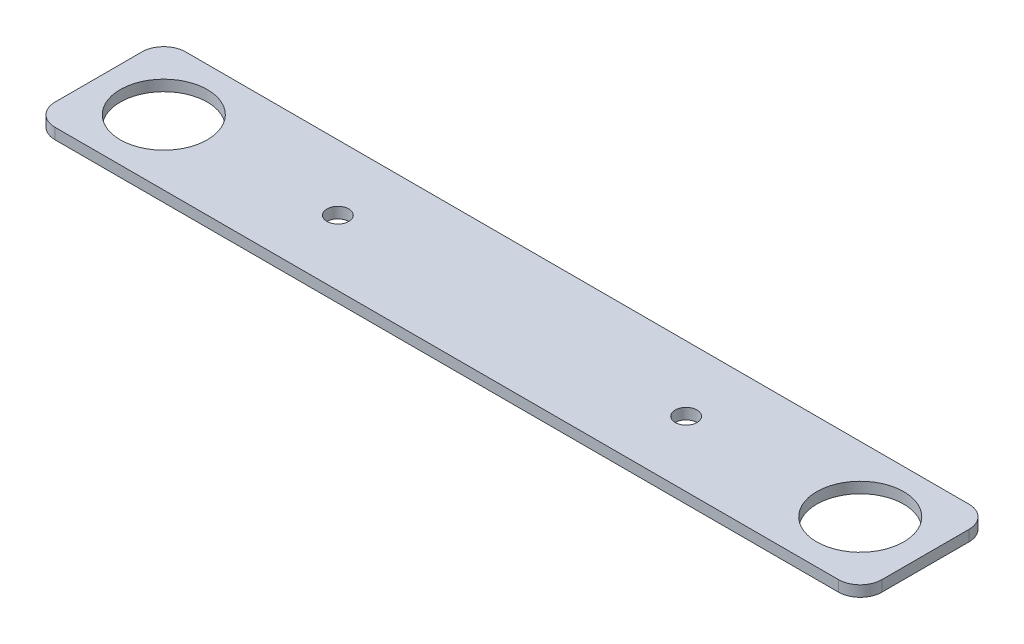
ISO-10303-21;
HEADER;
FILE_DESCRIPTION(('STEP AP214'),'2;1');
FILE_NAME('part.step','',(''),(''),'','','');
FILE_SCHEMA(('AUTOMOTIVE_DESIGN { 1 0 10303 214 1 1 1 1 }'));
ENDSEC;
DATA;
#1=APPLICATION_CONTEXT('core data for automotive mechanical design processes');
#2=APPLICATION_PROTOCOL_DEFINITION('international standard','automotive_design',2000,#1);
#3=PRODUCT_CONTEXT('',#1,'mechanical');
#4=PRODUCT('Part','Part','',(#3));
#5=PRODUCT_RELATED_PRODUCT_CATEGORY('part','',(#4));
#6=PRODUCT_DEFINITION_FORMATION('','',#4);
#7=PRODUCT_DEFINITION_CONTEXT('part definition',#1,'design');
#8=PRODUCT_DEFINITION('design','',#6,#7);
#9=PRODUCT_DEFINITION_SHAPE('','',#8);
#10=(LENGTH_UNIT() NAMED_UNIT(*) SI_UNIT(.MILLI.,.METRE.));
#11=(NAMED_UNIT(*) PLANE_ANGLE_UNIT() SI_UNIT($,.RADIAN.));
#12=(NAMED_UNIT(*) SI_UNIT($,.STERADIAN.) SOLID_ANGLE_UNIT());
#13=UNCERTAINTY_MEASURE_WITH_UNIT(LENGTH_MEASURE(1.E-05),#10,'distance_accuracy_value','');
#14=(GEOMETRIC_REPRESENTATION_CONTEXT(3) GLOBAL_UNCERTAINTY_ASSIGNED_CONTEXT((#13)) GLOBAL_UNIT_ASSIGNED_CONTEXT((#10,
#11,#12)) REPRESENTATION_CONTEXT('',''));
#15=CARTESIAN_POINT('',(0.,0.,0.));
#16=DIRECTION('',(0.,0.,1.));
#17=DIRECTION('',(1.,0.,0.));
#18=AXIS2_PLACEMENT_3D('',#15,#16,#17);
#19=CARTESIAN_POINT('',(215.9,3.175,12.7));
#20=DIRECTION('',(0.,1.,0.));
#21=DIRECTION('',(0.,0.,1.));
#22=AXIS2_PLACEMENT_3D('',#19,#20,#21);
#23=PLANE('',#22);
#24=CARTESIAN_POINT('',(50.8,3.175,0.));
#25=DIRECTION('',(0.,1.,0.));
#26=DIRECTION('',(0.,0.,1.));
#27=AXIS2_PLACEMENT_3D('',#24,#25,#26);
#28=CIRCLE('',#27,3.175);
#29=CARTESIAN_POINT('',(50.8,3.175,3.175));
#30=VERTEX_POINT('',#29);
#31=EDGE_CURVE('E187',#30,#30,#28,.T.);
#32=ORIENTED_EDGE('',*,*,#31,.F.);
#33=EDGE_LOOP('',(#32));
#34=FACE_BOUND('',#33,.T.);
#35=CARTESIAN_POINT('',(0.,3.175,0.));
#36=DIRECTION('',(0.,1.,0.));
#37=DIRECTION('',(0.,0.,1.));
#38=AXIS2_PLACEMENT_3D('',#35,#36,#37);
#39=CIRCLE('',#38,12.7);
#40=CARTESIAN_POINT('',(0.,3.175,12.7));
#41=VERTEX_POINT('',#40);
#42=EDGE_CURVE('E133',#41,#41,#39,.T.);
#43=ORIENTED_EDGE('',*,*,#42,.F.);
#44=EDGE_LOOP('',(#43));
#45=FACE_BOUND('',#44,.T.);
#46=CARTESIAN_POINT('',(215.9,3.175,12.7));
#47=DIRECTION('',(0.,1.,0.));
#48=DIRECTION('',(0.,0.,1.));
#49=AXIS2_PLACEMENT_3D('',#46,#47,#48);
#50=CIRCLE('',#49,6.35);
#51=CARTESIAN_POINT('',(215.9,3.175,19.05));
#52=VERTEX_POINT('',#51);
#53=CARTESIAN_POINT('',(222.25,3.175,12.7));
#54=VERTEX_POINT('',#53);
#55=EDGE_CURVE('E144',#52,#54,#50,.T.);
#56=ORIENTED_EDGE('',*,*,#55,.T.);
#57=DIRECTION('',(0.,0.,-1.));
#58=VECTOR('',#57,1.);
#59=CARTESIAN_POINT('',(222.25,3.175,12.7));
#60=LINE('',#59,#58);
#61=CARTESIAN_POINT('',(222.25,3.175,-12.7));
#62=VERTEX_POINT('',#61);
#63=EDGE_CURVE('E92',#54,#62,#60,.T.);
#64=ORIENTED_EDGE('',*,*,#63,.T.);
#65=CARTESIAN_POINT('',(215.9,3.175,-12.7));
#66=DIRECTION('',(0.,1.,0.));
#67=DIRECTION('',(0.,0.,-1.));
#68=AXIS2_PLACEMENT_3D('',#65,#66,#67);
#69=CIRCLE('',#68,6.35);
#70=CARTESIAN_POINT('',(215.9,3.175,-19.05));
#71=VERTEX_POINT('',#70);
#72=EDGE_CURVE('E159',#62,#71,#69,.T.);
#73=ORIENTED_EDGE('',*,*,#72,.T.);
#74=DIRECTION('',(-1.,0.,0.));
#75=VECTOR('',#74,1.);
#76=CARTESIAN_POINT('',(-12.7,3.175,-19.05));
#77=LINE('',#76,#75);
#78=CARTESIAN_POINT('',(-12.7,3.175,-19.05));
#79=VERTEX_POINT('',#78);
#80=EDGE_CURVE('E172',#71,#79,#77,.T.);
#81=ORIENTED_EDGE('',*,*,#80,.T.);
#82=CARTESIAN_POINT('',(-12.7,3.175,-12.7));
#83=DIRECTION('',(0.,1.,0.));
#84=DIRECTION('',(0.,0.,-1.));
#85=AXIS2_PLACEMENT_3D('',#82,#83,#84);
#86=CIRCLE('',#85,6.35);
#87=CARTESIAN_POINT('',(-19.05,3.175,-12.7));
#88=VERTEX_POINT('',#87);
#89=EDGE_CURVE('E111',#79,#88,#86,.T.);
#90=ORIENTED_EDGE('',*,*,#89,.T.);
#91=DIRECTION('',(0.,0.,1.));
#92=VECTOR('',#91,1.);
#93=CARTESIAN_POINT('',(-19.05,3.175,12.7));
#94=LINE('',#93,#92);
#95=CARTESIAN_POINT('',(-19.05,3.175,12.7));
#96=VERTEX_POINT('',#95);
#97=EDGE_CURVE('E105',#88,#96,#94,.T.);
#98=ORIENTED_EDGE('',*,*,#97,.T.);
#99=CARTESIAN_POINT('',(-12.7,3.175,12.7));
#100=DIRECTION('',(0.,1.,0.));
#101=DIRECTION('',(0.,0.,-1.));
#102=AXIS2_PLACEMENT_3D('',#99,#100,#101);
#103=CIRCLE('',#102,6.35);
#104=CARTESIAN_POINT('',(-12.7,3.175,19.05));
#105=VERTEX_POINT('',#104);
#106=EDGE_CURVE('E109',#96,#105,#103,.T.);
#107=ORIENTED_EDGE('',*,*,#106,.T.);
#108=DIRECTION('',(1.,0.,0.));
#109=VECTOR('',#108,1.);
#110=CARTESIAN_POINT('',(-12.7,3.175,19.05));
#111=LINE('',#110,#109);
#112=EDGE_CURVE('E49',#105,#52,#111,.T.);
#113=ORIENTED_EDGE('',*,*,#112,.T.);
#114=EDGE_LOOP('',(#56,#64,#73,#81,#90,#98,#107,#113));
#115=FACE_BOUND('',#114,.T.);
#116=CARTESIAN_POINT('',(203.2,3.175,0.));
#117=DIRECTION('',(0.,1.,0.));
#118=DIRECTION('',(0.,0.,1.));
#119=AXIS2_PLACEMENT_3D('',#116,#117,#118);
#120=CIRCLE('',#119,12.7);
#121=CARTESIAN_POINT('',(203.2,3.175,12.7));
#122=VERTEX_POINT('',#121);
#123=EDGE_CURVE('E181',#122,#122,#120,.T.);
#124=ORIENTED_EDGE('',*,*,#123,.F.);
#125=EDGE_LOOP('',(#124));
#126=FACE_BOUND('',#125,.T.);
#127=CARTESIAN_POINT('',(152.4,3.175,0.));
#128=DIRECTION('',(0.,1.,0.));
#129=DIRECTION('',(0.,0.,1.));
#130=AXIS2_PLACEMENT_3D('',#127,#128,#129);
#131=CIRCLE('',#130,3.175);
#132=CARTESIAN_POINT('',(152.4,3.175,3.175));
#133=VERTEX_POINT('',#132);
#134=EDGE_CURVE('E193',#133,#133,#131,.T.);
#135=ORIENTED_EDGE('',*,*,#134,.F.);
#136=EDGE_LOOP('',(#135));
#137=FACE_BOUND('',#136,.T.);
#138=ADVANCED_FACE('F32',(#34,#45,#115,#126,#137),#23,.T.);
#139=CARTESIAN_POINT('',(215.9,0.,12.7));
#140=DIRECTION('',(0.,1.,0.));
#141=DIRECTION('',(0.,0.,1.));
#142=AXIS2_PLACEMENT_3D('',#139,#140,#141);
#143=PLANE('',#142);
#144=CARTESIAN_POINT('',(215.9,0.,12.7));
#145=DIRECTION('',(0.,1.,0.));
#146=DIRECTION('',(0.,0.,1.));
#147=AXIS2_PLACEMENT_3D('',#144,#145,#146);
#148=CIRCLE('',#147,6.35);
#149=CARTESIAN_POINT('',(215.9,0.,19.05));
#150=VERTEX_POINT('',#149);
#151=CARTESIAN_POINT('',(222.25,0.,12.7));
#152=VERTEX_POINT('',#151);
#153=EDGE_CURVE('E129',#150,#152,#148,.T.);
#154=ORIENTED_EDGE('',*,*,#153,.F.);
#155=DIRECTION('',(1.,0.,0.));
#156=VECTOR('',#155,1.);
#157=CARTESIAN_POINT('',(-12.7,0.,19.05));
#158=LINE('',#157,#156);
#159=CARTESIAN_POINT('',(-12.7,0.,19.05));
#160=VERTEX_POINT('',#159);
#161=EDGE_CURVE('E84',#160,#150,#158,.T.);
#162=ORIENTED_EDGE('',*,*,#161,.F.);
#163=CARTESIAN_POINT('',(-12.7,0.,12.7));
#164=DIRECTION('',(0.,1.,0.));
#165=DIRECTION('',(0.,0.,-1.));
#166=AXIS2_PLACEMENT_3D('',#163,#164,#165);
#167=CIRCLE('',#166,6.35);
#168=CARTESIAN_POINT('',(-19.05,0.,12.7));
#169=VERTEX_POINT('',#168);
#170=EDGE_CURVE('E78',#169,#160,#167,.T.);
#171=ORIENTED_EDGE('',*,*,#170,.F.);
#172=DIRECTION('',(0.,0.,1.));
#173=VECTOR('',#172,1.);
#174=CARTESIAN_POINT('',(-19.05,0.,12.7));
#175=LINE('',#174,#173);
#176=CARTESIAN_POINT('',(-19.05,0.,-12.7));
#177=VERTEX_POINT('',#176);
#178=EDGE_CURVE('E119',#177,#169,#175,.T.);
#179=ORIENTED_EDGE('',*,*,#178,.F.);
#180=CARTESIAN_POINT('',(-12.7,0.,-12.7));
#181=DIRECTION('',(0.,1.,0.));
#182=DIRECTION('',(0.,0.,-1.));
#183=AXIS2_PLACEMENT_3D('',#180,#181,#182);
#184=CIRCLE('',#183,6.35);
#185=CARTESIAN_POINT('',(-12.7,0.,-19.05));
#186=VERTEX_POINT('',#185);
#187=EDGE_CURVE('E139',#186,#177,#184,.T.);
#188=ORIENTED_EDGE('',*,*,#187,.F.);
#189=DIRECTION('',(-1.,0.,0.));
#190=VECTOR('',#189,1.);
#191=CARTESIAN_POINT('',(-12.7,0.,-19.05));
#192=LINE('',#191,#190);
#193=CARTESIAN_POINT('',(215.9,0.,-19.05));
#194=VERTEX_POINT('',#193);
#195=EDGE_CURVE('E137',#194,#186,#192,.T.);
#196=ORIENTED_EDGE('',*,*,#195,.F.);
#197=CARTESIAN_POINT('',(215.9,0.,-12.7));
#198=DIRECTION('',(0.,1.,0.));
#199=DIRECTION('',(0.,0.,-1.));
#200=AXIS2_PLACEMENT_3D('',#197,#198,#199);
#201=CIRCLE('',#200,6.35);
#202=CARTESIAN_POINT('',(222.25,0.,-12.7));
#203=VERTEX_POINT('',#202);
#204=EDGE_CURVE('E135',#203,#194,#201,.T.);
#205=ORIENTED_EDGE('',*,*,#204,.F.);
#206=DIRECTION('',(0.,0.,-1.));
#207=VECTOR('',#206,1.);
#208=CARTESIAN_POINT('',(222.25,0.,12.7));
#209=LINE('',#208,#207);
#210=EDGE_CURVE('E132',#152,#203,#209,.T.);
#211=ORIENTED_EDGE('',*,*,#210,.F.);
#212=EDGE_LOOP('',(#154,#162,#171,#179,#188,#196,#205,#211));
#213=FACE_BOUND('',#212,.T.);
#214=CARTESIAN_POINT('',(0.,0.,0.));
#215=DIRECTION('',(0.,1.,0.));
#216=DIRECTION('',(0.,0.,1.));
#217=AXIS2_PLACEMENT_3D('',#214,#215,#216);
#218=CIRCLE('',#217,12.7);
#219=CARTESIAN_POINT('',(0.,0.,12.7));
#220=VERTEX_POINT('',#219);
#221=EDGE_CURVE('E178',#220,#220,#218,.T.);
#222=ORIENTED_EDGE('',*,*,#221,.T.);
#223=EDGE_LOOP('',(#222));
#224=FACE_BOUND('',#223,.T.);
#225=CARTESIAN_POINT('',(203.2,0.,0.));
#226=DIRECTION('',(0.,1.,0.));
#227=DIRECTION('',(0.,0.,1.));
#228=AXIS2_PLACEMENT_3D('',#225,#226,#227);
#229=CIRCLE('',#228,12.7);
#230=CARTESIAN_POINT('',(203.2,0.,12.7));
#231=VERTEX_POINT('',#230);
#232=EDGE_CURVE('E184',#231,#231,#229,.T.);
#233=ORIENTED_EDGE('',*,*,#232,.T.);
#234=EDGE_LOOP('',(#233));
#235=FACE_BOUND('',#234,.T.);
#236=CARTESIAN_POINT('',(50.8,0.,0.));
#237=DIRECTION('',(0.,1.,0.));
#238=DIRECTION('',(0.,0.,1.));
#239=AXIS2_PLACEMENT_3D('',#236,#237,#238);
#240=CIRCLE('',#239,3.175);
#241=CARTESIAN_POINT('',(50.8,0.,3.175));
#242=VERTEX_POINT('',#241);
#243=EDGE_CURVE('E190',#242,#242,#240,.T.);
#244=ORIENTED_EDGE('',*,*,#243,.T.);
#245=EDGE_LOOP('',(#244));
#246=FACE_BOUND('',#245,.T.);
#247=CARTESIAN_POINT('',(152.4,0.,0.));
#248=DIRECTION('',(0.,1.,0.));
#249=DIRECTION('',(0.,0.,1.));
#250=AXIS2_PLACEMENT_3D('',#247,#248,#249);
#251=CIRCLE('',#250,3.175);
#252=CARTESIAN_POINT('',(152.4,0.,3.175));
#253=VERTEX_POINT('',#252);
#254=EDGE_CURVE('E196',#253,#253,#251,.T.);
#255=ORIENTED_EDGE('',*,*,#254,.T.);
#256=EDGE_LOOP('',(#255));
#257=FACE_BOUND('',#256,.T.);
#258=ADVANCED_FACE('F163',(#213,#224,#235,#246,#257),#143,.F.);
#259=CARTESIAN_POINT('',(215.9,3.175,12.7));
#260=DIRECTION('',(0.,-1.,0.));
#261=DIRECTION('',(0.,0.,-1.));
#262=AXIS2_PLACEMENT_3D('',#259,#260,#261);
#263=CYLINDRICAL_SURFACE('',#262,6.35);
#264=ORIENTED_EDGE('',*,*,#153,.T.);
#265=DIRECTION('',(0.,-1.,0.));
#266=VECTOR('',#265,1.);
#267=CARTESIAN_POINT('',(222.25,3.175,12.7));
#268=LINE('',#267,#266);
#269=EDGE_CURVE('E11',#54,#152,#268,.T.);
#270=ORIENTED_EDGE('',*,*,#269,.F.);
#271=ORIENTED_EDGE('',*,*,#55,.F.);
#272=DIRECTION('',(0.,-1.,0.));
#273=VECTOR('',#272,1.);
#274=CARTESIAN_POINT('',(215.9,3.175,19.05));
#275=LINE('',#274,#273);
#276=EDGE_CURVE('E125',#52,#150,#275,.T.);
#277=ORIENTED_EDGE('',*,*,#276,.T.);
#278=EDGE_LOOP('',(#264,#270,#271,#277));
#279=FACE_BOUND('',#278,.T.);
#280=ADVANCED_FACE('F34',(#279),#263,.T.);
#281=CARTESIAN_POINT('',(222.25,3.175,12.7));
#282=DIRECTION('',(-1.,0.,0.));
#283=DIRECTION('',(0.,0.,1.));
#284=AXIS2_PLACEMENT_3D('',#281,#282,#283);
#285=PLANE('',#284);
#286=ORIENTED_EDGE('',*,*,#210,.T.);
#287=DIRECTION('',(0.,-1.,0.));
#288=VECTOR('',#287,1.);
#289=CARTESIAN_POINT('',(222.25,3.175,-12.7));
#290=LINE('',#289,#288);
#291=EDGE_CURVE('E41',#62,#203,#290,.T.);
#292=ORIENTED_EDGE('',*,*,#291,.F.);
#293=ORIENTED_EDGE('',*,*,#63,.F.);
#294=ORIENTED_EDGE('',*,*,#269,.T.);
#295=EDGE_LOOP('',(#286,#292,#293,#294));
#296=FACE_BOUND('',#295,.T.);
#297=ADVANCED_FACE('F230',(#296),#285,.F.);
#298=CARTESIAN_POINT('',(215.9,3.175,-12.7));
#299=DIRECTION('',(0.,-1.,0.));
#300=DIRECTION('',(0.,0.,-1.));
#301=AXIS2_PLACEMENT_3D('',#298,#299,#300);
#302=CYLINDRICAL_SURFACE('',#301,6.35);
#303=ORIENTED_EDGE('',*,*,#204,.T.);
#304=DIRECTION('',(0.,-1.,0.));
#305=VECTOR('',#304,1.);
#306=CARTESIAN_POINT('',(215.9,3.175,-19.05));
#307=LINE('',#306,#305);
#308=EDGE_CURVE('E151',#71,#194,#307,.T.);
#309=ORIENTED_EDGE('',*,*,#308,.F.);
#310=ORIENTED_EDGE('',*,*,#72,.F.);
#311=ORIENTED_EDGE('',*,*,#291,.T.);
#312=EDGE_LOOP('',(#303,#309,#310,#311));
#313=FACE_BOUND('',#312,.T.);
#314=ADVANCED_FACE('F157',(#313),#302,.T.);
#315=CARTESIAN_POINT('',(-12.7,3.175,-19.05));
#316=DIRECTION('',(0.,0.,1.));
#317=DIRECTION('',(1.,0.,0.));
#318=AXIS2_PLACEMENT_3D('',#315,#316,#317);
#319=PLANE('',#318);
#320=ORIENTED_EDGE('',*,*,#195,.T.);
#321=DIRECTION('',(0.,-1.,0.));
#322=VECTOR('',#321,1.);
#323=CARTESIAN_POINT('',(-12.7,3.175,-19.05));
#324=LINE('',#323,#322);
#325=EDGE_CURVE('E148',#79,#186,#324,.T.);
#326=ORIENTED_EDGE('',*,*,#325,.F.);
#327=ORIENTED_EDGE('',*,*,#80,.F.);
#328=ORIENTED_EDGE('',*,*,#308,.T.);
#329=EDGE_LOOP('',(#320,#326,#327,#328));
#330=FACE_BOUND('',#329,.T.);
#331=ADVANCED_FACE('F168',(#330),#319,.F.);
#332=CARTESIAN_POINT('',(-12.7,3.175,-12.7));
#333=DIRECTION('',(0.,-1.,0.));
#334=DIRECTION('',(0.,0.,-1.));
#335=AXIS2_PLACEMENT_3D('',#332,#333,#334);
#336=CYLINDRICAL_SURFACE('',#335,6.35);
#337=ORIENTED_EDGE('',*,*,#187,.T.);
#338=DIRECTION('',(0.,-1.,0.));
#339=VECTOR('',#338,1.);
#340=CARTESIAN_POINT('',(-19.05,3.175,-12.7));
#341=LINE('',#340,#339);
#342=EDGE_CURVE('E120',#88,#177,#341,.T.);
#343=ORIENTED_EDGE('',*,*,#342,.F.);
#344=ORIENTED_EDGE('',*,*,#89,.F.);
#345=ORIENTED_EDGE('',*,*,#325,.T.);
#346=EDGE_LOOP('',(#337,#343,#344,#345));
#347=FACE_BOUND('',#346,.T.);
#348=ADVANCED_FACE('F171',(#347),#336,.T.);
#349=CARTESIAN_POINT('',(-19.05,3.175,12.7));
#350=DIRECTION('',(1.,0.,0.));
#351=DIRECTION('',(0.,0.,-1.));
#352=AXIS2_PLACEMENT_3D('',#349,#350,#351);
#353=PLANE('',#352);
#354=ORIENTED_EDGE('',*,*,#178,.T.);
#355=DIRECTION('',(0.,-1.,0.));
#356=VECTOR('',#355,1.);
#357=CARTESIAN_POINT('',(-19.05,3.175,12.7));
#358=LINE('',#357,#356);
#359=EDGE_CURVE('E116',#96,#169,#358,.T.);
#360=ORIENTED_EDGE('',*,*,#359,.F.);
#361=ORIENTED_EDGE('',*,*,#97,.F.);
#362=ORIENTED_EDGE('',*,*,#342,.T.);
#363=EDGE_LOOP('',(#354,#360,#361,#362));
#364=FACE_BOUND('',#363,.T.);
#365=ADVANCED_FACE('F117',(#364),#353,.F.);
#366=CARTESIAN_POINT('',(-12.7,3.175,12.7));
#367=DIRECTION('',(0.,-1.,0.));
#368=DIRECTION('',(0.,0.,-1.));
#369=AXIS2_PLACEMENT_3D('',#366,#367,#368);
#370=CYLINDRICAL_SURFACE('',#369,6.35);
#371=ORIENTED_EDGE('',*,*,#170,.T.);
#372=DIRECTION('',(0.,-1.,0.));
#373=VECTOR('',#372,1.);
#374=CARTESIAN_POINT('',(-12.7,3.175,19.05));
#375=LINE('',#374,#373);
#376=EDGE_CURVE('E121',#105,#160,#375,.T.);
#377=ORIENTED_EDGE('',*,*,#376,.F.);
#378=ORIENTED_EDGE('',*,*,#106,.F.);
#379=ORIENTED_EDGE('',*,*,#359,.T.);
#380=EDGE_LOOP('',(#371,#377,#378,#379));
#381=FACE_BOUND('',#380,.T.);
#382=ADVANCED_FACE('F123',(#381),#370,.T.);
#383=CARTESIAN_POINT('',(-12.7,3.175,19.05));
#384=DIRECTION('',(0.,0.,-1.));
#385=DIRECTION('',(-1.,0.,0.));
#386=AXIS2_PLACEMENT_3D('',#383,#384,#385);
#387=PLANE('',#386);
#388=ORIENTED_EDGE('',*,*,#161,.T.);
#389=ORIENTED_EDGE('',*,*,#276,.F.);
#390=ORIENTED_EDGE('',*,*,#112,.F.);
#391=ORIENTED_EDGE('',*,*,#376,.T.);
#392=EDGE_LOOP('',(#388,#389,#390,#391));
#393=FACE_BOUND('',#392,.T.);
#394=ADVANCED_FACE('F218',(#393),#387,.F.);
#395=CARTESIAN_POINT('',(0.,3.175,0.));
#396=DIRECTION('',(0.,-1.,0.));
#397=DIRECTION('',(0.,0.,-1.));
#398=AXIS2_PLACEMENT_3D('',#395,#396,#397);
#399=CYLINDRICAL_SURFACE('',#398,12.7);
#400=ORIENTED_EDGE('',*,*,#42,.T.);
#401=EDGE_LOOP('',(#400));
#402=FACE_BOUND('',#401,.T.);
#403=ORIENTED_EDGE('',*,*,#221,.F.);
#404=EDGE_LOOP('',(#403));
#405=FACE_BOUND('',#404,.T.);
#406=ADVANCED_FACE('F215',(#402,#405),#399,.F.);
#407=CARTESIAN_POINT('',(203.2,3.175,0.));
#408=DIRECTION('',(0.,-1.,0.));
#409=DIRECTION('',(0.,0.,-1.));
#410=AXIS2_PLACEMENT_3D('',#407,#408,#409);
#411=CYLINDRICAL_SURFACE('',#410,12.7);
#412=ORIENTED_EDGE('',*,*,#123,.T.);
#413=EDGE_LOOP('',(#412));
#414=FACE_BOUND('',#413,.T.);
#415=ORIENTED_EDGE('',*,*,#232,.F.);
#416=EDGE_LOOP('',(#415));
#417=FACE_BOUND('',#416,.T.);
#418=ADVANCED_FACE('F294',(#414,#417),#411,.F.);
#419=CARTESIAN_POINT('',(50.8,3.175,0.));
#420=DIRECTION('',(0.,-1.,0.));
#421=DIRECTION('',(0.,0.,-1.));
#422=AXIS2_PLACEMENT_3D('',#419,#420,#421);
#423=CYLINDRICAL_SURFACE('',#422,3.175);
#424=ORIENTED_EDGE('',*,*,#31,.T.);
#425=EDGE_LOOP('',(#424));
#426=FACE_BOUND('',#425,.T.);
#427=ORIENTED_EDGE('',*,*,#243,.F.);
#428=EDGE_LOOP('',(#427));
#429=FACE_BOUND('',#428,.T.);
#430=ADVANCED_FACE('F302',(#426,#429),#423,.F.);
#431=CARTESIAN_POINT('',(152.4,3.175,0.));
#432=DIRECTION('',(0.,-1.,0.));
#433=DIRECTION('',(0.,0.,-1.));
#434=AXIS2_PLACEMENT_3D('',#431,#432,#433);
#435=CYLINDRICAL_SURFACE('',#434,3.175);
#436=ORIENTED_EDGE('',*,*,#134,.T.);
#437=EDGE_LOOP('',(#436));
#438=FACE_BOUND('',#437,.T.);
#439=ORIENTED_EDGE('',*,*,#254,.F.);
#440=EDGE_LOOP('',(#439));
#441=FACE_BOUND('',#440,.T.);
#442=ADVANCED_FACE('F202',(#438,#441),#435,.F.);
#443=CLOSED_SHELL('',(#138,#258,#280,#297,#314,#331,#348,#365,#382,#394,#406,#418,#430,#442));
#444=MANIFOLD_SOLID_BREP('B2',#443);
#445=ADVANCED_BREP_SHAPE_REPRESENTATION('',(#18,#444),#14);
#446=SHAPE_DEFINITION_REPRESENTATION(#9,#445);
ENDSEC;
END-ISO-10303-21;
